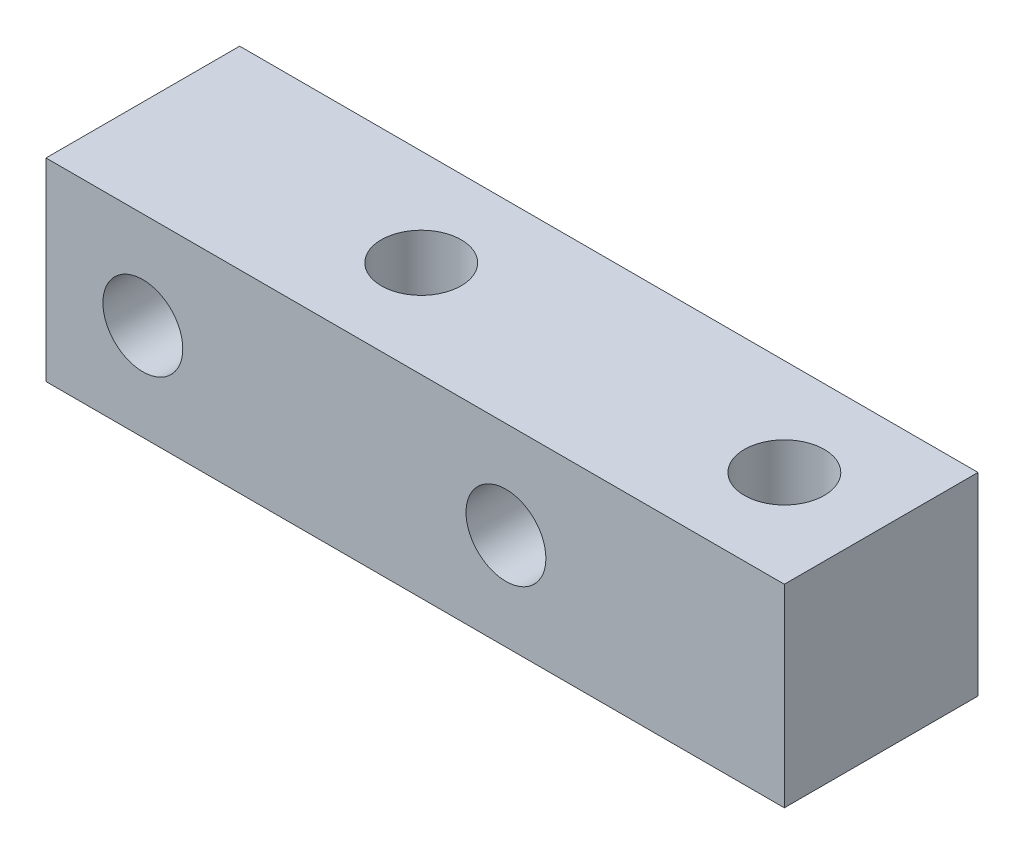
ISO-10303-21;
HEADER;
FILE_DESCRIPTION(('STEP AP214'),'2;1');
FILE_NAME('part.step','',(''),(''),'','','');
FILE_SCHEMA(('AUTOMOTIVE_DESIGN { 1 0 10303 214 1 1 1 1 }'));
ENDSEC;
DATA;
#1=APPLICATION_CONTEXT('core data for automotive mechanical design processes');
#2=APPLICATION_PROTOCOL_DEFINITION('international standard','automotive_design',2000,#1);
#3=PRODUCT_CONTEXT('',#1,'mechanical');
#4=PRODUCT('Part','Part','',(#3));
#5=PRODUCT_RELATED_PRODUCT_CATEGORY('part','',(#4));
#6=PRODUCT_DEFINITION_FORMATION('','',#4);
#7=PRODUCT_DEFINITION_CONTEXT('part definition',#1,'design');
#8=PRODUCT_DEFINITION('design','',#6,#7);
#9=PRODUCT_DEFINITION_SHAPE('','',#8);
#10=(LENGTH_UNIT() NAMED_UNIT(*) SI_UNIT(.MILLI.,.METRE.));
#11=(NAMED_UNIT(*) PLANE_ANGLE_UNIT() SI_UNIT($,.RADIAN.));
#12=(NAMED_UNIT(*) SI_UNIT($,.STERADIAN.) SOLID_ANGLE_UNIT());
#13=UNCERTAINTY_MEASURE_WITH_UNIT(LENGTH_MEASURE(1.E-05),#10,'distance_accuracy_value','');
#14=(GEOMETRIC_REPRESENTATION_CONTEXT(3) GLOBAL_UNCERTAINTY_ASSIGNED_CONTEXT((#13)) GLOBAL_UNIT_ASSIGNED_CONTEXT((#10,
#11,#12)) REPRESENTATION_CONTEXT('',''));
#15=CARTESIAN_POINT('',(0.,0.,0.));
#16=DIRECTION('',(0.,0.,1.));
#17=DIRECTION('',(1.,0.,0.));
#18=AXIS2_PLACEMENT_3D('',#15,#16,#17);
#19=CARTESIAN_POINT('',(15.25,-4.,8.));
#20=DIRECTION('',(-1.,0.,0.));
#21=DIRECTION('',(0.,0.,1.));
#22=AXIS2_PLACEMENT_3D('',#19,#20,#21);
#23=PLANE('',#22);
#24=DIRECTION('',(0.,1.,0.));
#25=VECTOR('',#24,1.);
#26=CARTESIAN_POINT('',(15.25,-4.,0.));
#27=LINE('',#26,#25);
#28=CARTESIAN_POINT('',(15.25,-4.,0.));
#29=VERTEX_POINT('',#28);
#30=CARTESIAN_POINT('',(15.25,4.,0.));
#31=VERTEX_POINT('',#30);
#32=EDGE_CURVE('E101',#29,#31,#27,.T.);
#33=ORIENTED_EDGE('',*,*,#32,.T.);
#34=DIRECTION('',(0.,0.,-1.));
#35=VECTOR('',#34,1.);
#36=CARTESIAN_POINT('',(15.25,4.,8.));
#37=LINE('',#36,#35);
#38=CARTESIAN_POINT('',(15.25,4.,8.));
#39=VERTEX_POINT('',#38);
#40=EDGE_CURVE('E11',#39,#31,#37,.T.);
#41=ORIENTED_EDGE('',*,*,#40,.F.);
#42=DIRECTION('',(0.,1.,0.));
#43=VECTOR('',#42,1.);
#44=CARTESIAN_POINT('',(15.25,-4.,8.));
#45=LINE('',#44,#43);
#46=CARTESIAN_POINT('',(15.25,-4.,8.));
#47=VERTEX_POINT('',#46);
#48=EDGE_CURVE('E89',#47,#39,#45,.T.);
#49=ORIENTED_EDGE('',*,*,#48,.F.);
#50=DIRECTION('',(0.,0.,-1.));
#51=VECTOR('',#50,1.);
#52=CARTESIAN_POINT('',(15.25,-4.,8.));
#53=LINE('',#52,#51);
#54=EDGE_CURVE('E97',#47,#29,#53,.T.);
#55=ORIENTED_EDGE('',*,*,#54,.T.);
#56=EDGE_LOOP('',(#33,#41,#49,#55));
#57=FACE_BOUND('',#56,.T.);
#58=ADVANCED_FACE('F38',(#57),#23,.F.);
#59=CARTESIAN_POINT('',(-15.25,4.,8.));
#60=DIRECTION('',(0.,-1.,0.));
#61=DIRECTION('',(0.,0.,-1.));
#62=AXIS2_PLACEMENT_3D('',#59,#60,#61);
#63=PLANE('',#62);
#64=CARTESIAN_POINT('',(-3.75,4.,4.));
#65=DIRECTION('',(0.,1.,0.));
#66=DIRECTION('',(0.,0.,1.));
#67=AXIS2_PLACEMENT_3D('',#64,#65,#66);
#68=CIRCLE('',#67,1.64999999999999);
#69=CARTESIAN_POINT('',(-3.75,4.,5.64999999999999));
#70=VERTEX_POINT('',#69);
#71=EDGE_CURVE('E135',#70,#70,#68,.T.);
#72=ORIENTED_EDGE('',*,*,#71,.F.);
#73=EDGE_LOOP('',(#72));
#74=FACE_BOUND('',#73,.T.);
#75=CARTESIAN_POINT('',(11.25,4.,4.));
#76=DIRECTION('',(0.,1.,0.));
#77=DIRECTION('',(0.,0.,1.));
#78=AXIS2_PLACEMENT_3D('',#75,#76,#77);
#79=CIRCLE('',#78,1.64999999999999);
#80=CARTESIAN_POINT('',(11.25,4.,5.64999999999999));
#81=VERTEX_POINT('',#80);
#82=EDGE_CURVE('E129',#81,#81,#79,.T.);
#83=ORIENTED_EDGE('',*,*,#82,.F.);
#84=EDGE_LOOP('',(#83));
#85=FACE_BOUND('',#84,.T.);
#86=DIRECTION('',(-1.,0.,0.));
#87=VECTOR('',#86,1.);
#88=CARTESIAN_POINT('',(-15.25,4.,0.));
#89=LINE('',#88,#87);
#90=CARTESIAN_POINT('',(-15.25,4.,0.));
#91=VERTEX_POINT('',#90);
#92=EDGE_CURVE('E93',#31,#91,#89,.T.);
#93=ORIENTED_EDGE('',*,*,#92,.T.);
#94=DIRECTION('',(0.,0.,-1.));
#95=VECTOR('',#94,1.);
#96=CARTESIAN_POINT('',(-15.25,4.,8.));
#97=LINE('',#96,#95);
#98=CARTESIAN_POINT('',(-15.25,4.,8.));
#99=VERTEX_POINT('',#98);
#100=EDGE_CURVE('E46',#99,#91,#97,.T.);
#101=ORIENTED_EDGE('',*,*,#100,.F.);
#102=DIRECTION('',(-1.,0.,0.));
#103=VECTOR('',#102,1.);
#104=CARTESIAN_POINT('',(-15.25,4.,8.));
#105=LINE('',#104,#103);
#106=EDGE_CURVE('E84',#39,#99,#105,.T.);
#107=ORIENTED_EDGE('',*,*,#106,.F.);
#108=ORIENTED_EDGE('',*,*,#40,.T.);
#109=EDGE_LOOP('',(#93,#101,#107,#108));
#110=FACE_BOUND('',#109,.T.);
#111=ADVANCED_FACE('F92',(#74,#85,#110),#63,.F.);
#112=CARTESIAN_POINT('',(-15.25,-4.,8.));
#113=DIRECTION('',(1.,0.,0.));
#114=DIRECTION('',(0.,0.,-1.));
#115=AXIS2_PLACEMENT_3D('',#112,#113,#114);
#116=PLANE('',#115);
#117=DIRECTION('',(0.,-1.,0.));
#118=VECTOR('',#117,1.);
#119=CARTESIAN_POINT('',(-15.25,-4.,0.));
#120=LINE('',#119,#118);
#121=CARTESIAN_POINT('',(-15.25,-4.,0.));
#122=VERTEX_POINT('',#121);
#123=EDGE_CURVE('E71',#91,#122,#120,.T.);
#124=ORIENTED_EDGE('',*,*,#123,.T.);
#125=DIRECTION('',(0.,0.,-1.));
#126=VECTOR('',#125,1.);
#127=CARTESIAN_POINT('',(-15.25,-4.,8.));
#128=LINE('',#127,#126);
#129=CARTESIAN_POINT('',(-15.25,-4.,8.));
#130=VERTEX_POINT('',#129);
#131=EDGE_CURVE('E94',#130,#122,#128,.T.);
#132=ORIENTED_EDGE('',*,*,#131,.F.);
#133=DIRECTION('',(0.,-1.,0.));
#134=VECTOR('',#133,1.);
#135=CARTESIAN_POINT('',(-15.25,-4.,8.));
#136=LINE('',#135,#134);
#137=EDGE_CURVE('E87',#99,#130,#136,.T.);
#138=ORIENTED_EDGE('',*,*,#137,.F.);
#139=ORIENTED_EDGE('',*,*,#100,.T.);
#140=EDGE_LOOP('',(#124,#132,#138,#139));
#141=FACE_BOUND('',#140,.T.);
#142=ADVANCED_FACE('F95',(#141),#116,.F.);
#143=CARTESIAN_POINT('',(-15.25,-4.,8.));
#144=DIRECTION('',(0.,1.,0.));
#145=DIRECTION('',(0.,0.,1.));
#146=AXIS2_PLACEMENT_3D('',#143,#144,#145);
#147=PLANE('',#146);
#148=CARTESIAN_POINT('',(-3.75,-4.,4.));
#149=DIRECTION('',(0.,1.,0.));
#150=DIRECTION('',(0.,0.,1.));
#151=AXIS2_PLACEMENT_3D('',#148,#149,#150);
#152=CIRCLE('',#151,1.65);
#153=CARTESIAN_POINT('',(-3.75,-4.,5.65));
#154=VERTEX_POINT('',#153);
#155=EDGE_CURVE('E132',#154,#154,#152,.T.);
#156=ORIENTED_EDGE('',*,*,#155,.T.);
#157=EDGE_LOOP('',(#156));
#158=FACE_BOUND('',#157,.T.);
#159=CARTESIAN_POINT('',(11.25,-4.,4.));
#160=DIRECTION('',(0.,1.,0.));
#161=DIRECTION('',(0.,0.,1.));
#162=AXIS2_PLACEMENT_3D('',#159,#160,#161);
#163=CIRCLE('',#162,1.65);
#164=CARTESIAN_POINT('',(11.25,-4.,5.65));
#165=VERTEX_POINT('',#164);
#166=EDGE_CURVE('E126',#165,#165,#163,.T.);
#167=ORIENTED_EDGE('',*,*,#166,.T.);
#168=EDGE_LOOP('',(#167));
#169=FACE_BOUND('',#168,.T.);
#170=DIRECTION('',(1.,0.,0.));
#171=VECTOR('',#170,1.);
#172=CARTESIAN_POINT('',(-15.25,-4.,0.));
#173=LINE('',#172,#171);
#174=EDGE_CURVE('E77',#122,#29,#173,.T.);
#175=ORIENTED_EDGE('',*,*,#174,.T.);
#176=ORIENTED_EDGE('',*,*,#54,.F.);
#177=DIRECTION('',(1.,0.,0.));
#178=VECTOR('',#177,1.);
#179=CARTESIAN_POINT('',(-15.25,-4.,8.));
#180=LINE('',#179,#178);
#181=EDGE_CURVE('E54',#130,#47,#180,.T.);
#182=ORIENTED_EDGE('',*,*,#181,.F.);
#183=ORIENTED_EDGE('',*,*,#131,.T.);
#184=EDGE_LOOP('',(#175,#176,#182,#183));
#185=FACE_BOUND('',#184,.T.);
#186=ADVANCED_FACE('F109',(#158,#169,#185),#147,.F.);
#187=CARTESIAN_POINT('',(0.,0.,8.));
#188=DIRECTION('',(0.,0.,-1.));
#189=DIRECTION('',(-1.,0.,0.));
#190=AXIS2_PLACEMENT_3D('',#187,#188,#189);
#191=PLANE('',#190);
#192=CARTESIAN_POINT('',(3.75,0.,8.));
#193=DIRECTION('',(0.,0.,1.));
#194=DIRECTION('',(1.,0.,0.));
#195=AXIS2_PLACEMENT_3D('',#192,#193,#194);
#196=CIRCLE('',#195,1.64999999999999);
#197=CARTESIAN_POINT('',(5.39999999999998,0.,8.));
#198=VERTEX_POINT('',#197);
#199=EDGE_CURVE('E123',#198,#198,#196,.T.);
#200=ORIENTED_EDGE('',*,*,#199,.F.);
#201=EDGE_LOOP('',(#200));
#202=FACE_BOUND('',#201,.T.);
#203=CARTESIAN_POINT('',(-11.25,0.,8.));
#204=DIRECTION('',(0.,0.,1.));
#205=DIRECTION('',(1.,0.,0.));
#206=AXIS2_PLACEMENT_3D('',#203,#204,#205);
#207=CIRCLE('',#206,1.64999999999999);
#208=CARTESIAN_POINT('',(-9.60000000000002,0.,8.));
#209=VERTEX_POINT('',#208);
#210=EDGE_CURVE('E117',#209,#209,#207,.T.);
#211=ORIENTED_EDGE('',*,*,#210,.F.);
#212=EDGE_LOOP('',(#211));
#213=FACE_BOUND('',#212,.T.);
#214=ORIENTED_EDGE('',*,*,#48,.T.);
#215=ORIENTED_EDGE('',*,*,#106,.T.);
#216=ORIENTED_EDGE('',*,*,#137,.T.);
#217=ORIENTED_EDGE('',*,*,#181,.T.);
#218=EDGE_LOOP('',(#214,#215,#216,#217));
#219=FACE_BOUND('',#218,.T.);
#220=ADVANCED_FACE('F85',(#202,#213,#219),#191,.F.);
#221=CARTESIAN_POINT('',(0.,0.,0.));
#222=DIRECTION('',(0.,0.,-1.));
#223=DIRECTION('',(-1.,0.,0.));
#224=AXIS2_PLACEMENT_3D('',#221,#222,#223);
#225=PLANE('',#224);
#226=CARTESIAN_POINT('',(3.75,0.,0.));
#227=DIRECTION('',(0.,0.,1.));
#228=DIRECTION('',(1.,0.,0.));
#229=AXIS2_PLACEMENT_3D('',#226,#227,#228);
#230=CIRCLE('',#229,1.65);
#231=CARTESIAN_POINT('',(5.4,0.,0.));
#232=VERTEX_POINT('',#231);
#233=EDGE_CURVE('E120',#232,#232,#230,.T.);
#234=ORIENTED_EDGE('',*,*,#233,.T.);
#235=EDGE_LOOP('',(#234));
#236=FACE_BOUND('',#235,.T.);
#237=CARTESIAN_POINT('',(-11.25,0.,0.));
#238=DIRECTION('',(0.,0.,1.));
#239=DIRECTION('',(1.,0.,0.));
#240=AXIS2_PLACEMENT_3D('',#237,#238,#239);
#241=CIRCLE('',#240,1.65);
#242=CARTESIAN_POINT('',(-9.6,0.,0.));
#243=VERTEX_POINT('',#242);
#244=EDGE_CURVE('E104',#243,#243,#241,.T.);
#245=ORIENTED_EDGE('',*,*,#244,.T.);
#246=EDGE_LOOP('',(#245));
#247=FACE_BOUND('',#246,.T.);
#248=ORIENTED_EDGE('',*,*,#32,.F.);
#249=ORIENTED_EDGE('',*,*,#174,.F.);
#250=ORIENTED_EDGE('',*,*,#123,.F.);
#251=ORIENTED_EDGE('',*,*,#92,.F.);
#252=EDGE_LOOP('',(#248,#249,#250,#251));
#253=FACE_BOUND('',#252,.T.);
#254=ADVANCED_FACE('F112',(#236,#247,#253),#225,.T.);
#255=CARTESIAN_POINT('',(-11.25,0.,8.));
#256=DIRECTION('',(0.,0.,1.));
#257=DIRECTION('',(1.,0.,0.));
#258=AXIS2_PLACEMENT_3D('',#255,#256,#257);
#259=CYLINDRICAL_SURFACE('',#258,1.64999999999999);
#260=ORIENTED_EDGE('',*,*,#244,.F.);
#261=EDGE_LOOP('',(#260));
#262=FACE_BOUND('',#261,.T.);
#263=ORIENTED_EDGE('',*,*,#210,.T.);
#264=EDGE_LOOP('',(#263));
#265=FACE_BOUND('',#264,.T.);
#266=ADVANCED_FACE('F156',(#262,#265),#259,.F.);
#267=CARTESIAN_POINT('',(3.75,0.,8.));
#268=DIRECTION('',(0.,0.,1.));
#269=DIRECTION('',(1.,0.,0.));
#270=AXIS2_PLACEMENT_3D('',#267,#268,#269);
#271=CYLINDRICAL_SURFACE('',#270,1.64999999999999);
#272=ORIENTED_EDGE('',*,*,#233,.F.);
#273=EDGE_LOOP('',(#272));
#274=FACE_BOUND('',#273,.T.);
#275=ORIENTED_EDGE('',*,*,#199,.T.);
#276=EDGE_LOOP('',(#275));
#277=FACE_BOUND('',#276,.T.);
#278=ADVANCED_FACE('F147',(#274,#277),#271,.F.);
#279=CARTESIAN_POINT('',(11.25,4.,4.));
#280=DIRECTION('',(0.,1.,0.));
#281=DIRECTION('',(0.,0.,1.));
#282=AXIS2_PLACEMENT_3D('',#279,#280,#281);
#283=CYLINDRICAL_SURFACE('',#282,1.64999999999999);
#284=ORIENTED_EDGE('',*,*,#166,.F.);
#285=EDGE_LOOP('',(#284));
#286=FACE_BOUND('',#285,.T.);
#287=ORIENTED_EDGE('',*,*,#82,.T.);
#288=EDGE_LOOP('',(#287));
#289=FACE_BOUND('',#288,.T.);
#290=ADVANCED_FACE('F145',(#286,#289),#283,.F.);
#291=CARTESIAN_POINT('',(-3.75,4.,4.));
#292=DIRECTION('',(0.,1.,0.));
#293=DIRECTION('',(0.,0.,1.));
#294=AXIS2_PLACEMENT_3D('',#291,#292,#293);
#295=CYLINDRICAL_SURFACE('',#294,1.64999999999999);
#296=ORIENTED_EDGE('',*,*,#155,.F.);
#297=EDGE_LOOP('',(#296));
#298=FACE_BOUND('',#297,.T.);
#299=ORIENTED_EDGE('',*,*,#71,.T.);
#300=EDGE_LOOP('',(#299));
#301=FACE_BOUND('',#300,.T.);
#302=ADVANCED_FACE('F139',(#298,#301),#295,.F.);
#303=CLOSED_SHELL('',(#58,#111,#142,#186,#220,#254,#266,#278,#290,#302));
#304=MANIFOLD_SOLID_BREP('B2',#303);
#305=ADVANCED_BREP_SHAPE_REPRESENTATION('',(#18,#304),#14);
#306=SHAPE_DEFINITION_REPRESENTATION(#9,#305);
ENDSEC;
END-ISO-10303-21;
